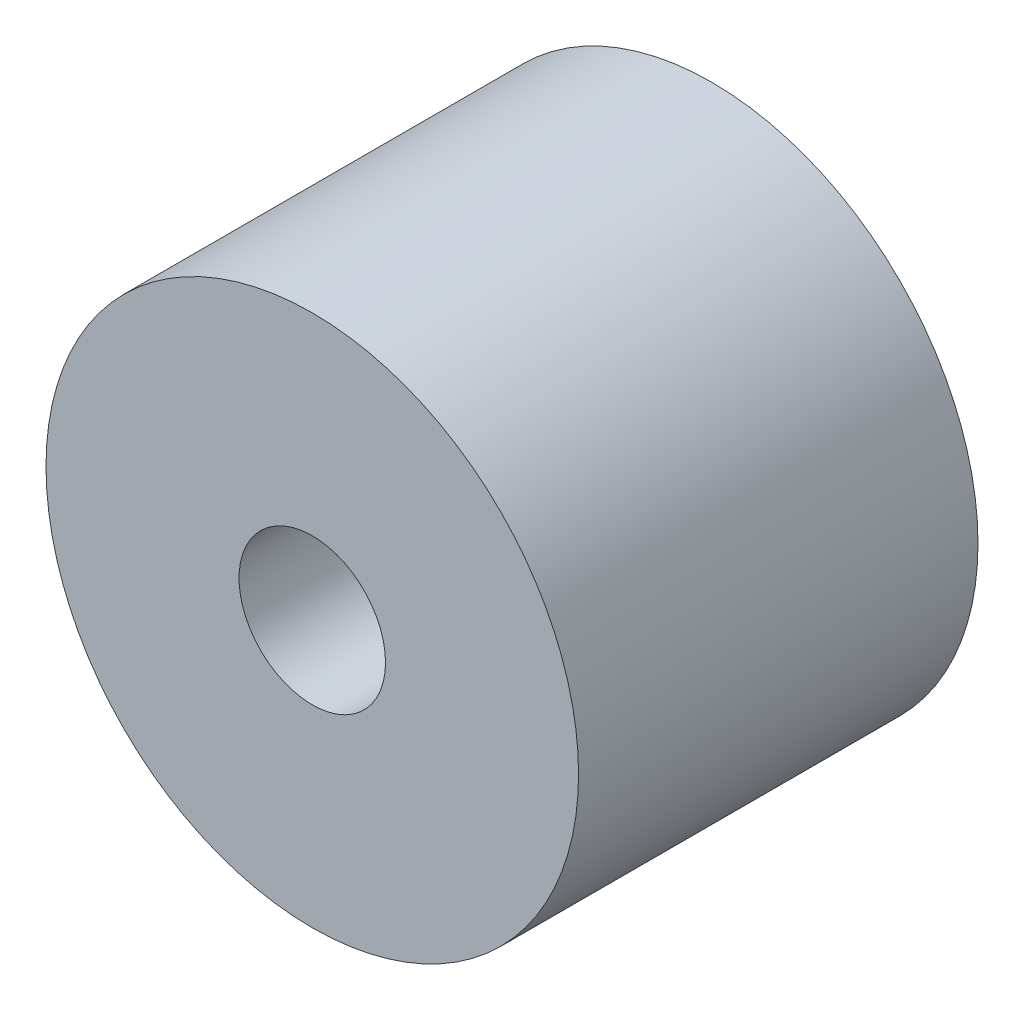
ISO-10303-21;
HEADER;
FILE_DESCRIPTION(('STEP AP214'),'2;1');
FILE_NAME('part.step','',(''),(''),'','','');
FILE_SCHEMA(('AUTOMOTIVE_DESIGN { 1 0 10303 214 1 1 1 1 }'));
ENDSEC;
DATA;
#1=APPLICATION_CONTEXT('core data for automotive mechanical design processes');
#2=APPLICATION_PROTOCOL_DEFINITION('international standard','automotive_design',2000,#1);
#3=PRODUCT_CONTEXT('',#1,'mechanical');
#4=PRODUCT('Part','Part','',(#3));
#5=PRODUCT_RELATED_PRODUCT_CATEGORY('part','',(#4));
#6=PRODUCT_DEFINITION_FORMATION('','',#4);
#7=PRODUCT_DEFINITION_CONTEXT('part definition',#1,'design');
#8=PRODUCT_DEFINITION('design','',#6,#7);
#9=PRODUCT_DEFINITION_SHAPE('','',#8);
#10=(LENGTH_UNIT() NAMED_UNIT(*) SI_UNIT(.MILLI.,.METRE.));
#11=(NAMED_UNIT(*) PLANE_ANGLE_UNIT() SI_UNIT($,.RADIAN.));
#12=(NAMED_UNIT(*) SI_UNIT($,.STERADIAN.) SOLID_ANGLE_UNIT());
#13=UNCERTAINTY_MEASURE_WITH_UNIT(LENGTH_MEASURE(1.E-05),#10,'distance_accuracy_value','');
#14=(GEOMETRIC_REPRESENTATION_CONTEXT(3) GLOBAL_UNCERTAINTY_ASSIGNED_CONTEXT((#13)) GLOBAL_UNIT_ASSIGNED_CONTEXT((#10,
#11,#12)) REPRESENTATION_CONTEXT('',''));
#15=CARTESIAN_POINT('',(0.,0.,0.));
#16=DIRECTION('',(0.,0.,1.));
#17=DIRECTION('',(1.,0.,0.));
#18=AXIS2_PLACEMENT_3D('',#15,#16,#17);
#19=CARTESIAN_POINT('',(0.,0.,7.5));
#20=DIRECTION('',(0.,0.,1.));
#21=DIRECTION('',(1.,0.,0.));
#22=AXIS2_PLACEMENT_3D('',#19,#20,#21);
#23=PLANE('',#22);
#24=CARTESIAN_POINT('',(0.,0.,7.5));
#25=DIRECTION('',(0.,0.,1.));
#26=DIRECTION('',(1.,0.,0.));
#27=AXIS2_PLACEMENT_3D('',#24,#25,#26);
#28=CIRCLE('',#27,10.);
#29=CARTESIAN_POINT('',(10.,0.,7.5));
#30=VERTEX_POINT('',#29);
#31=EDGE_CURVE('E10',#30,#30,#28,.T.);
#32=ORIENTED_EDGE('',*,*,#31,.T.);
#33=EDGE_LOOP('',(#32));
#34=FACE_BOUND('',#33,.T.);
#35=CARTESIAN_POINT('',(0.,0.,7.5));
#36=DIRECTION('',(0.,0.,1.));
#37=DIRECTION('',(1.,0.,0.));
#38=AXIS2_PLACEMENT_3D('',#35,#36,#37);
#39=CIRCLE('',#38,2.75);
#40=CARTESIAN_POINT('',(2.75,0.,7.5));
#41=VERTEX_POINT('',#40);
#42=EDGE_CURVE('E41',#41,#41,#39,.T.);
#43=ORIENTED_EDGE('',*,*,#42,.F.);
#44=EDGE_LOOP('',(#43));
#45=FACE_BOUND('',#44,.T.);
#46=ADVANCED_FACE('F30',(#34,#45),#23,.T.);
#47=CARTESIAN_POINT('',(0.,0.,-7.5));
#48=DIRECTION('',(0.,0.,1.));
#49=DIRECTION('',(1.,0.,0.));
#50=AXIS2_PLACEMENT_3D('',#47,#48,#49);
#51=PLANE('',#50);
#52=CARTESIAN_POINT('',(0.,0.,-7.5));
#53=DIRECTION('',(0.,0.,1.));
#54=DIRECTION('',(1.,0.,0.));
#55=AXIS2_PLACEMENT_3D('',#52,#53,#54);
#56=CIRCLE('',#55,10.);
#57=CARTESIAN_POINT('',(10.,0.,-7.5));
#58=VERTEX_POINT('',#57);
#59=EDGE_CURVE('E34',#58,#58,#56,.T.);
#60=ORIENTED_EDGE('',*,*,#59,.F.);
#61=EDGE_LOOP('',(#60));
#62=FACE_BOUND('',#61,.T.);
#63=CARTESIAN_POINT('',(0.,0.,-7.5));
#64=DIRECTION('',(0.,0.,1.));
#65=DIRECTION('',(1.,0.,0.));
#66=AXIS2_PLACEMENT_3D('',#63,#64,#65);
#67=CIRCLE('',#66,2.75);
#68=CARTESIAN_POINT('',(2.75,0.,-7.5));
#69=VERTEX_POINT('',#68);
#70=EDGE_CURVE('E43',#69,#69,#67,.T.);
#71=ORIENTED_EDGE('',*,*,#70,.T.);
#72=EDGE_LOOP('',(#71));
#73=FACE_BOUND('',#72,.T.);
#74=ADVANCED_FACE('F53',(#62,#73),#51,.F.);
#75=CARTESIAN_POINT('',(0.,0.,7.5));
#76=DIRECTION('',(0.,0.,-1.));
#77=DIRECTION('',(-1.,0.,0.));
#78=AXIS2_PLACEMENT_3D('',#75,#76,#77);
#79=CYLINDRICAL_SURFACE('',#78,10.);
#80=ORIENTED_EDGE('',*,*,#31,.F.);
#81=EDGE_LOOP('',(#80));
#82=FACE_BOUND('',#81,.T.);
#83=ORIENTED_EDGE('',*,*,#59,.T.);
#84=EDGE_LOOP('',(#83));
#85=FACE_BOUND('',#84,.T.);
#86=ADVANCED_FACE('F32',(#82,#85),#79,.T.);
#87=CARTESIAN_POINT('',(0.,0.,7.5));
#88=DIRECTION('',(0.,0.,-1.));
#89=DIRECTION('',(-1.,0.,0.));
#90=AXIS2_PLACEMENT_3D('',#87,#88,#89);
#91=CYLINDRICAL_SURFACE('',#90,2.75);
#92=ORIENTED_EDGE('',*,*,#42,.T.);
#93=EDGE_LOOP('',(#92));
#94=FACE_BOUND('',#93,.T.);
#95=ORIENTED_EDGE('',*,*,#70,.F.);
#96=EDGE_LOOP('',(#95));
#97=FACE_BOUND('',#96,.T.);
#98=ADVANCED_FACE('F49',(#94,#97),#91,.F.);
#99=CLOSED_SHELL('',(#46,#74,#86,#98));
#100=MANIFOLD_SOLID_BREP('B2',#99);
#101=ADVANCED_BREP_SHAPE_REPRESENTATION('',(#18,#100),#14);
#102=SHAPE_DEFINITION_REPRESENTATION(#9,#101);
ENDSEC;
END-ISO-10303-21;
